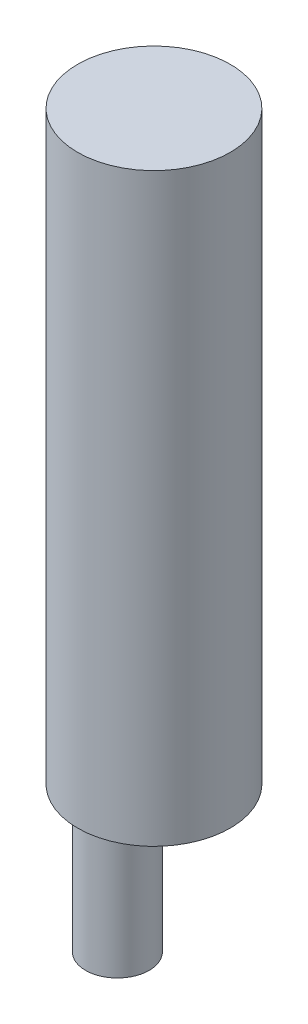
ISO-10303-21;
HEADER;
FILE_DESCRIPTION(('STEP AP214'),'2;1');
FILE_NAME('part.step','',(''),(''),'','','');
FILE_SCHEMA(('AUTOMOTIVE_DESIGN { 1 0 10303 214 1 1 1 1 }'));
ENDSEC;
DATA;
#1=APPLICATION_CONTEXT('core data for automotive mechanical design processes');
#2=APPLICATION_PROTOCOL_DEFINITION('international standard','automotive_design',2000,#1);
#3=PRODUCT_CONTEXT('',#1,'mechanical');
#4=PRODUCT('Part','Part','',(#3));
#5=PRODUCT_RELATED_PRODUCT_CATEGORY('part','',(#4));
#6=PRODUCT_DEFINITION_FORMATION('','',#4);
#7=PRODUCT_DEFINITION_CONTEXT('part definition',#1,'design');
#8=PRODUCT_DEFINITION('design','',#6,#7);
#9=PRODUCT_DEFINITION_SHAPE('','',#8);
#10=(LENGTH_UNIT() NAMED_UNIT(*) SI_UNIT(.MILLI.,.METRE.));
#11=(NAMED_UNIT(*) PLANE_ANGLE_UNIT() SI_UNIT($,.RADIAN.));
#12=(NAMED_UNIT(*) SI_UNIT($,.STERADIAN.) SOLID_ANGLE_UNIT());
#13=UNCERTAINTY_MEASURE_WITH_UNIT(LENGTH_MEASURE(1.E-05),#10,'distance_accuracy_value','');
#14=(GEOMETRIC_REPRESENTATION_CONTEXT(3) GLOBAL_UNCERTAINTY_ASSIGNED_CONTEXT((#13)) GLOBAL_UNIT_ASSIGNED_CONTEXT((#10,
#11,#12)) REPRESENTATION_CONTEXT('',''));
#15=CARTESIAN_POINT('',(0.,0.,0.));
#16=DIRECTION('',(0.,0.,1.));
#17=DIRECTION('',(1.,0.,0.));
#18=AXIS2_PLACEMENT_3D('',#15,#16,#17);
#19=CARTESIAN_POINT('',(0.,34.5,0.));
#20=DIRECTION('',(0.,-1.,0.));
#21=DIRECTION('',(0.,0.,-1.));
#22=AXIS2_PLACEMENT_3D('',#19,#20,#21);
#23=CYLINDRICAL_SURFACE('',#22,9.);
#24=CARTESIAN_POINT('',(0.,34.5,0.));
#25=DIRECTION('',(0.,1.,0.));
#26=DIRECTION('',(0.,0.,1.));
#27=AXIS2_PLACEMENT_3D('',#24,#25,#26);
#28=CIRCLE('',#27,9.);
#29=CARTESIAN_POINT('',(0.,34.5,9.));
#30=VERTEX_POINT('',#29);
#31=EDGE_CURVE('E48',#30,#30,#28,.T.);
#32=ORIENTED_EDGE('',*,*,#31,.F.);
#33=EDGE_LOOP('',(#32));
#34=FACE_BOUND('',#33,.T.);
#35=CARTESIAN_POINT('',(0.,-34.5,0.));
#36=DIRECTION('',(0.,1.,0.));
#37=DIRECTION('',(0.,0.,1.));
#38=AXIS2_PLACEMENT_3D('',#35,#36,#37);
#39=CIRCLE('',#38,9.);
#40=CARTESIAN_POINT('',(0.,-34.5,9.));
#41=VERTEX_POINT('',#40);
#42=EDGE_CURVE('E53',#41,#41,#39,.T.);
#43=ORIENTED_EDGE('',*,*,#42,.T.);
#44=EDGE_LOOP('',(#43));
#45=FACE_BOUND('',#44,.T.);
#46=ADVANCED_FACE('F41',(#34,#45),#23,.T.);
#47=CARTESIAN_POINT('',(0.,34.5,0.));
#48=DIRECTION('',(0.,1.,0.));
#49=DIRECTION('',(0.,0.,1.));
#50=AXIS2_PLACEMENT_3D('',#47,#48,#49);
#51=PLANE('',#50);
#52=ORIENTED_EDGE('',*,*,#31,.T.);
#53=EDGE_LOOP('',(#52));
#54=FACE_BOUND('',#53,.T.);
#55=ADVANCED_FACE('F76',(#54),#51,.T.);
#56=CARTESIAN_POINT('',(0.,-34.5,0.));
#57=DIRECTION('',(0.,1.,0.));
#58=DIRECTION('',(0.,0.,1.));
#59=AXIS2_PLACEMENT_3D('',#56,#57,#58);
#60=PLANE('',#59);
#61=CARTESIAN_POINT('',(0.,-34.5,4.3106204796348));
#62=DIRECTION('',(0.,1.,0.));
#63=DIRECTION('',(0.,0.,1.));
#64=AXIS2_PLACEMENT_3D('',#61,#62,#63);
#65=CIRCLE('',#64,3.75);
#66=CARTESIAN_POINT('',(0.,-34.5,8.0606204796348));
#67=VERTEX_POINT('',#66);
#68=EDGE_CURVE('E10',#67,#67,#65,.F.);
#69=ORIENTED_EDGE('',*,*,#68,.F.);
#70=EDGE_LOOP('',(#69));
#71=FACE_BOUND('',#70,.T.);
#72=ORIENTED_EDGE('',*,*,#42,.F.);
#73=EDGE_LOOP('',(#72));
#74=FACE_BOUND('',#73,.T.);
#75=ADVANCED_FACE('F69',(#71,#74),#60,.F.);
#76=CARTESIAN_POINT('',(0.,-49.5,4.3106204796348));
#77=DIRECTION('',(0.,1.,0.));
#78=DIRECTION('',(0.,0.,1.));
#79=AXIS2_PLACEMENT_3D('',#76,#77,#78);
#80=CYLINDRICAL_SURFACE('',#79,3.75);
#81=CARTESIAN_POINT('',(0.,-49.5,4.3106204796348));
#82=DIRECTION('',(0.,-1.,0.));
#83=DIRECTION('',(0.,0.,-1.));
#84=AXIS2_PLACEMENT_3D('',#81,#82,#83);
#85=CIRCLE('',#84,3.75);
#86=CARTESIAN_POINT('',(0.,-49.5,0.560620479634806));
#87=VERTEX_POINT('',#86);
#88=EDGE_CURVE('E59',#87,#87,#85,.T.);
#89=ORIENTED_EDGE('',*,*,#88,.F.);
#90=EDGE_LOOP('',(#89));
#91=FACE_BOUND('',#90,.T.);
#92=ORIENTED_EDGE('',*,*,#68,.T.);
#93=EDGE_LOOP('',(#92));
#94=FACE_BOUND('',#93,.T.);
#95=ADVANCED_FACE('F67',(#91,#94),#80,.T.);
#96=CARTESIAN_POINT('',(0.,-49.5,4.3106204796348));
#97=DIRECTION('',(0.,-1.,0.));
#98=DIRECTION('',(0.,0.,-1.));
#99=AXIS2_PLACEMENT_3D('',#96,#97,#98);
#100=PLANE('',#99);
#101=ORIENTED_EDGE('',*,*,#88,.T.);
#102=EDGE_LOOP('',(#101));
#103=FACE_BOUND('',#102,.T.);
#104=ADVANCED_FACE('F65',(#103),#100,.T.);
#105=CLOSED_SHELL('',(#46,#55,#75,#95,#104));
#106=MANIFOLD_SOLID_BREP('B2',#105);
#107=ADVANCED_BREP_SHAPE_REPRESENTATION('',(#18,#106),#14);
#108=SHAPE_DEFINITION_REPRESENTATION(#9,#107);
ENDSEC;
END-ISO-10303-21;
